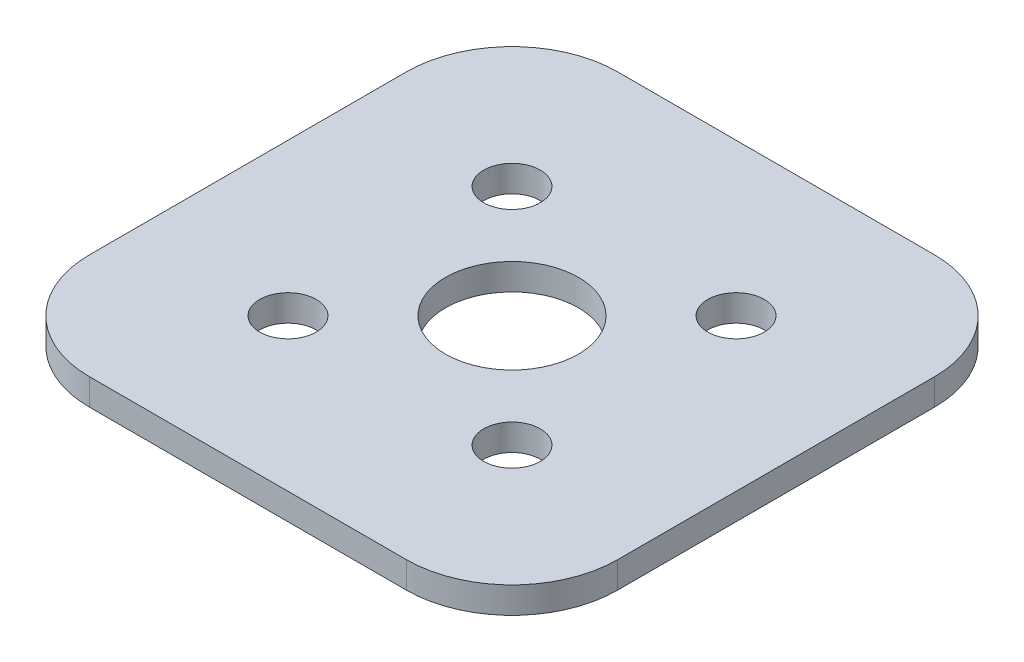
ISO-10303-21;
HEADER;
FILE_DESCRIPTION(('STEP AP214'),'2;1');
FILE_NAME('part.step','',(''),(''),'','','');
FILE_SCHEMA(('AUTOMOTIVE_DESIGN { 1 0 10303 214 1 1 1 1 }'));
ENDSEC;
DATA;
#1=APPLICATION_CONTEXT('core data for automotive mechanical design processes');
#2=APPLICATION_PROTOCOL_DEFINITION('international standard','automotive_design',2000,#1);
#3=PRODUCT_CONTEXT('',#1,'mechanical');
#4=PRODUCT('Part','Part','',(#3));
#5=PRODUCT_RELATED_PRODUCT_CATEGORY('part','',(#4));
#6=PRODUCT_DEFINITION_FORMATION('','',#4);
#7=PRODUCT_DEFINITION_CONTEXT('part definition',#1,'design');
#8=PRODUCT_DEFINITION('design','',#6,#7);
#9=PRODUCT_DEFINITION_SHAPE('','',#8);
#10=(LENGTH_UNIT() NAMED_UNIT(*) SI_UNIT(.MILLI.,.METRE.));
#11=(NAMED_UNIT(*) PLANE_ANGLE_UNIT() SI_UNIT($,.RADIAN.));
#12=(NAMED_UNIT(*) SI_UNIT($,.STERADIAN.) SOLID_ANGLE_UNIT());
#13=UNCERTAINTY_MEASURE_WITH_UNIT(LENGTH_MEASURE(1.E-05),#10,'distance_accuracy_value','');
#14=(GEOMETRIC_REPRESENTATION_CONTEXT(3) GLOBAL_UNCERTAINTY_ASSIGNED_CONTEXT((#13)) GLOBAL_UNIT_ASSIGNED_CONTEXT((#10,
#11,#12)) REPRESENTATION_CONTEXT('',''));
#15=CARTESIAN_POINT('',(0.,0.,0.));
#16=DIRECTION('',(0.,0.,1.));
#17=DIRECTION('',(1.,0.,0.));
#18=AXIS2_PLACEMENT_3D('',#15,#16,#17);
#19=CARTESIAN_POINT('',(-9.52500000000001,1.5875,-9.525));
#20=DIRECTION('',(0.,-1.,0.));
#21=DIRECTION('',(0.,0.,-1.));
#22=AXIS2_PLACEMENT_3D('',#19,#20,#21);
#23=PLANE('',#22);
#24=CARTESIAN_POINT('',(-9.52500000000001,1.5875,-9.525));
#25=DIRECTION('',(0.,1.,0.));
#26=DIRECTION('',(0.,0.,-1.));
#27=AXIS2_PLACEMENT_3D('',#24,#25,#26);
#28=CIRCLE('',#27,6.35);
#29=CARTESIAN_POINT('',(-9.52499999999996,1.5875,-15.875));
#30=VERTEX_POINT('',#29);
#31=CARTESIAN_POINT('',(-15.875,1.5875,-9.52499999999995));
#32=VERTEX_POINT('',#31);
#33=EDGE_CURVE('E168',#30,#32,#28,.T.);
#34=ORIENTED_EDGE('',*,*,#33,.T.);
#35=DIRECTION('',(0.,0.,1.));
#36=VECTOR('',#35,1.);
#37=CARTESIAN_POINT('',(-15.875,1.5875,-9.52499999999995));
#38=LINE('',#37,#36);
#39=CARTESIAN_POINT('',(-15.875,1.5875,9.52499999999996));
#40=VERTEX_POINT('',#39);
#41=EDGE_CURVE('E104',#32,#40,#38,.T.);
#42=ORIENTED_EDGE('',*,*,#41,.T.);
#43=CARTESIAN_POINT('',(-9.525,1.5875,9.525));
#44=DIRECTION('',(0.,1.,0.));
#45=DIRECTION('',(0.,0.,-1.));
#46=AXIS2_PLACEMENT_3D('',#43,#44,#45);
#47=CIRCLE('',#46,6.35);
#48=CARTESIAN_POINT('',(-9.52499999999995,1.5875,15.875));
#49=VERTEX_POINT('',#48);
#50=EDGE_CURVE('E189',#40,#49,#47,.T.);
#51=ORIENTED_EDGE('',*,*,#50,.T.);
#52=DIRECTION('',(1.,0.,0.));
#53=VECTOR('',#52,1.);
#54=CARTESIAN_POINT('',(-9.52499999999995,1.5875,15.875));
#55=LINE('',#54,#53);
#56=CARTESIAN_POINT('',(9.52499999999996,1.5875,15.875));
#57=VERTEX_POINT('',#56);
#58=EDGE_CURVE('E203',#49,#57,#55,.T.);
#59=ORIENTED_EDGE('',*,*,#58,.T.);
#60=CARTESIAN_POINT('',(9.525,1.5875,9.52500000000001));
#61=DIRECTION('',(0.,1.,0.));
#62=DIRECTION('',(0.,0.,1.));
#63=AXIS2_PLACEMENT_3D('',#60,#61,#62);
#64=CIRCLE('',#63,6.35);
#65=CARTESIAN_POINT('',(15.875,1.5875,9.52499999999996));
#66=VERTEX_POINT('',#65);
#67=EDGE_CURVE('E123',#57,#66,#64,.T.);
#68=ORIENTED_EDGE('',*,*,#67,.T.);
#69=DIRECTION('',(0.,0.,-1.));
#70=VECTOR('',#69,1.);
#71=CARTESIAN_POINT('',(15.875,1.5875,-9.52499999999995));
#72=LINE('',#71,#70);
#73=CARTESIAN_POINT('',(15.875,1.5875,-9.52499999999995));
#74=VERTEX_POINT('',#73);
#75=EDGE_CURVE('E117',#66,#74,#72,.T.);
#76=ORIENTED_EDGE('',*,*,#75,.T.);
#77=CARTESIAN_POINT('',(9.52499999999999,1.5875,-9.525));
#78=DIRECTION('',(0.,1.,0.));
#79=DIRECTION('',(0.,0.,-1.));
#80=AXIS2_PLACEMENT_3D('',#77,#78,#79);
#81=CIRCLE('',#80,6.35);
#82=CARTESIAN_POINT('',(9.52499999999995,1.5875,-15.875));
#83=VERTEX_POINT('',#82);
#84=EDGE_CURVE('E121',#74,#83,#81,.T.);
#85=ORIENTED_EDGE('',*,*,#84,.T.);
#86=DIRECTION('',(-1.,0.,0.));
#87=VECTOR('',#86,1.);
#88=CARTESIAN_POINT('',(-9.52499999999996,1.5875,-15.875));
#89=LINE('',#88,#87);
#90=EDGE_CURVE('E61',#83,#30,#89,.T.);
#91=ORIENTED_EDGE('',*,*,#90,.T.);
#92=EDGE_LOOP('',(#34,#42,#51,#59,#68,#76,#85,#91));
#93=FACE_BOUND('',#92,.T.);
#94=CARTESIAN_POINT('',(-6.73519209080184,1.5875,6.73519209080188));
#95=DIRECTION('',(0.,1.,0.));
#96=DIRECTION('',(0.,0.,1.));
#97=AXIS2_PLACEMENT_3D('',#94,#95,#96);
#98=CIRCLE('',#97,1.6999966);
#99=CARTESIAN_POINT('',(-6.73519209080184,1.5875,8.43518869080188));
#100=VERTEX_POINT('',#99);
#101=EDGE_CURVE('E150',#100,#100,#98,.T.);
#102=ORIENTED_EDGE('',*,*,#101,.F.);
#103=EDGE_LOOP('',(#102));
#104=FACE_BOUND('',#103,.T.);
#105=CARTESIAN_POINT('',(6.73519209080183,1.5875,6.7351920908019));
#106=DIRECTION('',(0.,1.,0.));
#107=DIRECTION('',(0.,0.,1.));
#108=AXIS2_PLACEMENT_3D('',#105,#106,#107);
#109=CIRCLE('',#108,1.6999966);
#110=CARTESIAN_POINT('',(6.73519209080183,1.5875,8.4351886908019));
#111=VERTEX_POINT('',#110);
#112=EDGE_CURVE('E217',#111,#111,#109,.T.);
#113=ORIENTED_EDGE('',*,*,#112,.F.);
#114=EDGE_LOOP('',(#113));
#115=FACE_BOUND('',#114,.T.);
#116=CARTESIAN_POINT('',(0.,1.5875,0.));
#117=DIRECTION('',(0.,1.,0.));
#118=DIRECTION('',(0.,0.,1.));
#119=AXIS2_PLACEMENT_3D('',#116,#117,#118);
#120=CIRCLE('',#119,4.00000000000001);
#121=CARTESIAN_POINT('',(0.,1.5875,4.00000000000001));
#122=VERTEX_POINT('',#121);
#123=EDGE_CURVE('E225',#122,#122,#120,.T.);
#124=ORIENTED_EDGE('',*,*,#123,.F.);
#125=EDGE_LOOP('',(#124));
#126=FACE_BOUND('',#125,.T.);
#127=CARTESIAN_POINT('',(6.73519209080183,1.5875,-6.73519209080189));
#128=DIRECTION('',(0.,1.,0.));
#129=DIRECTION('',(0.,0.,1.));
#130=AXIS2_PLACEMENT_3D('',#127,#128,#129);
#131=CIRCLE('',#130,1.6999966);
#132=CARTESIAN_POINT('',(6.73519209080183,1.5875,-5.03519549080189));
#133=VERTEX_POINT('',#132);
#134=EDGE_CURVE('E233',#133,#133,#131,.T.);
#135=ORIENTED_EDGE('',*,*,#134,.F.);
#136=EDGE_LOOP('',(#135));
#137=FACE_BOUND('',#136,.T.);
#138=CARTESIAN_POINT('',(-6.73519209080184,1.5875,-6.73519209080188));
#139=DIRECTION('',(0.,1.,0.));
#140=DIRECTION('',(0.,0.,1.));
#141=AXIS2_PLACEMENT_3D('',#138,#139,#140);
#142=CIRCLE('',#141,1.6999966);
#143=CARTESIAN_POINT('',(-6.73519209080184,1.5875,-5.03519549080188));
#144=VERTEX_POINT('',#143);
#145=EDGE_CURVE('E241',#144,#144,#142,.T.);
#146=ORIENTED_EDGE('',*,*,#145,.F.);
#147=EDGE_LOOP('',(#146));
#148=FACE_BOUND('',#147,.T.);
#149=ADVANCED_FACE('F43',(#93,#104,#115,#126,#137,#148),#23,.F.);
#150=CARTESIAN_POINT('',(-9.52500000000001,0.,-9.525));
#151=DIRECTION('',(0.,-1.,0.));
#152=DIRECTION('',(0.,0.,-1.));
#153=AXIS2_PLACEMENT_3D('',#150,#151,#152);
#154=PLANE('',#153);
#155=CARTESIAN_POINT('',(6.73519209080183,0.,-6.73519209080189));
#156=DIRECTION('',(0.,1.,0.));
#157=DIRECTION('',(0.,0.,1.));
#158=AXIS2_PLACEMENT_3D('',#155,#156,#157);
#159=CIRCLE('',#158,1.6999966);
#160=CARTESIAN_POINT('',(6.73519209080183,0.,-5.03519549080189));
#161=VERTEX_POINT('',#160);
#162=EDGE_CURVE('E237',#161,#161,#159,.T.);
#163=ORIENTED_EDGE('',*,*,#162,.T.);
#164=EDGE_LOOP('',(#163));
#165=FACE_BOUND('',#164,.T.);
#166=CARTESIAN_POINT('',(6.73519209080183,0.,6.7351920908019));
#167=DIRECTION('',(0.,1.,0.));
#168=DIRECTION('',(0.,0.,1.));
#169=AXIS2_PLACEMENT_3D('',#166,#167,#168);
#170=CIRCLE('',#169,1.6999966);
#171=CARTESIAN_POINT('',(6.73519209080183,0.,8.4351886908019));
#172=VERTEX_POINT('',#171);
#173=EDGE_CURVE('E221',#172,#172,#170,.T.);
#174=ORIENTED_EDGE('',*,*,#173,.T.);
#175=EDGE_LOOP('',(#174));
#176=FACE_BOUND('',#175,.T.);
#177=CARTESIAN_POINT('',(-9.52500000000001,0.,-9.525));
#178=DIRECTION('',(0.,1.,0.));
#179=DIRECTION('',(0.,0.,-1.));
#180=AXIS2_PLACEMENT_3D('',#177,#178,#179);
#181=CIRCLE('',#180,6.35);
#182=CARTESIAN_POINT('',(-9.52499999999996,0.,-15.875));
#183=VERTEX_POINT('',#182);
#184=CARTESIAN_POINT('',(-15.875,0.,-9.52499999999995));
#185=VERTEX_POINT('',#184);
#186=EDGE_CURVE('E145',#183,#185,#181,.T.);
#187=ORIENTED_EDGE('',*,*,#186,.F.);
#188=DIRECTION('',(-1.,0.,0.));
#189=VECTOR('',#188,1.);
#190=CARTESIAN_POINT('',(-9.52499999999996,0.,-15.875));
#191=LINE('',#190,#189);
#192=CARTESIAN_POINT('',(9.52499999999995,0.,-15.875));
#193=VERTEX_POINT('',#192);
#194=EDGE_CURVE('E96',#193,#183,#191,.T.);
#195=ORIENTED_EDGE('',*,*,#194,.F.);
#196=CARTESIAN_POINT('',(9.52499999999999,0.,-9.525));
#197=DIRECTION('',(0.,1.,0.));
#198=DIRECTION('',(0.,0.,-1.));
#199=AXIS2_PLACEMENT_3D('',#196,#197,#198);
#200=CIRCLE('',#199,6.35);
#201=CARTESIAN_POINT('',(15.875,0.,-9.52499999999995));
#202=VERTEX_POINT('',#201);
#203=EDGE_CURVE('E90',#202,#193,#200,.T.);
#204=ORIENTED_EDGE('',*,*,#203,.F.);
#205=DIRECTION('',(0.,0.,-1.));
#206=VECTOR('',#205,1.);
#207=CARTESIAN_POINT('',(15.875,0.,-9.52499999999995));
#208=LINE('',#207,#206);
#209=CARTESIAN_POINT('',(15.875,0.,9.52499999999996));
#210=VERTEX_POINT('',#209);
#211=EDGE_CURVE('E132',#210,#202,#208,.T.);
#212=ORIENTED_EDGE('',*,*,#211,.F.);
#213=CARTESIAN_POINT('',(9.525,0.,9.52500000000001));
#214=DIRECTION('',(0.,1.,0.));
#215=DIRECTION('',(0.,0.,1.));
#216=AXIS2_PLACEMENT_3D('',#213,#214,#215);
#217=CIRCLE('',#216,6.35);
#218=CARTESIAN_POINT('',(9.52499999999996,0.,15.875));
#219=VERTEX_POINT('',#218);
#220=EDGE_CURVE('E159',#219,#210,#217,.T.);
#221=ORIENTED_EDGE('',*,*,#220,.F.);
#222=DIRECTION('',(1.,0.,0.));
#223=VECTOR('',#222,1.);
#224=CARTESIAN_POINT('',(-9.52499999999995,0.,15.875));
#225=LINE('',#224,#223);
#226=CARTESIAN_POINT('',(-9.52499999999995,0.,15.875));
#227=VERTEX_POINT('',#226);
#228=EDGE_CURVE('E156',#227,#219,#225,.T.);
#229=ORIENTED_EDGE('',*,*,#228,.F.);
#230=CARTESIAN_POINT('',(-9.525,0.,9.525));
#231=DIRECTION('',(0.,1.,0.));
#232=DIRECTION('',(0.,0.,-1.));
#233=AXIS2_PLACEMENT_3D('',#230,#231,#232);
#234=CIRCLE('',#233,6.35);
#235=CARTESIAN_POINT('',(-15.875,0.,9.52499999999996));
#236=VERTEX_POINT('',#235);
#237=EDGE_CURVE('E153',#236,#227,#234,.T.);
#238=ORIENTED_EDGE('',*,*,#237,.F.);
#239=DIRECTION('',(0.,0.,1.));
#240=VECTOR('',#239,1.);
#241=CARTESIAN_POINT('',(-15.875,0.,-9.52499999999995));
#242=LINE('',#241,#240);
#243=EDGE_CURVE('E149',#185,#236,#242,.T.);
#244=ORIENTED_EDGE('',*,*,#243,.F.);
#245=EDGE_LOOP('',(#187,#195,#204,#212,#221,#229,#238,#244));
#246=FACE_BOUND('',#245,.T.);
#247=CARTESIAN_POINT('',(-6.73519209080184,0.,6.73519209080188));
#248=DIRECTION('',(0.,1.,0.));
#249=DIRECTION('',(0.,0.,1.));
#250=AXIS2_PLACEMENT_3D('',#247,#248,#249);
#251=CIRCLE('',#250,1.6999966);
#252=CARTESIAN_POINT('',(-6.73519209080184,0.,8.43518869080188));
#253=VERTEX_POINT('',#252);
#254=EDGE_CURVE('E213',#253,#253,#251,.T.);
#255=ORIENTED_EDGE('',*,*,#254,.T.);
#256=EDGE_LOOP('',(#255));
#257=FACE_BOUND('',#256,.T.);
#258=CARTESIAN_POINT('',(0.,0.,0.));
#259=DIRECTION('',(0.,1.,0.));
#260=DIRECTION('',(0.,0.,1.));
#261=AXIS2_PLACEMENT_3D('',#258,#259,#260);
#262=CIRCLE('',#261,4.00000000000001);
#263=CARTESIAN_POINT('',(0.,0.,4.00000000000001));
#264=VERTEX_POINT('',#263);
#265=EDGE_CURVE('E229',#264,#264,#262,.T.);
#266=ORIENTED_EDGE('',*,*,#265,.T.);
#267=EDGE_LOOP('',(#266));
#268=FACE_BOUND('',#267,.T.);
#269=CARTESIAN_POINT('',(-6.73519209080184,0.,-6.73519209080188));
#270=DIRECTION('',(0.,1.,0.));
#271=DIRECTION('',(0.,0.,1.));
#272=AXIS2_PLACEMENT_3D('',#269,#270,#271);
#273=CIRCLE('',#272,1.6999966);
#274=CARTESIAN_POINT('',(-6.73519209080184,0.,-5.03519549080188));
#275=VERTEX_POINT('',#274);
#276=EDGE_CURVE('E245',#275,#275,#273,.T.);
#277=ORIENTED_EDGE('',*,*,#276,.T.);
#278=EDGE_LOOP('',(#277));
#279=FACE_BOUND('',#278,.T.);
#280=ADVANCED_FACE('F193',(#165,#176,#246,#257,#268,#279),#154,.T.);
#281=CARTESIAN_POINT('',(-9.52500000000001,1.5875,-9.525));
#282=DIRECTION('',(0.,-1.,0.));
#283=DIRECTION('',(0.,0.,-1.));
#284=AXIS2_PLACEMENT_3D('',#281,#282,#283);
#285=CYLINDRICAL_SURFACE('',#284,6.35);
#286=ORIENTED_EDGE('',*,*,#186,.T.);
#287=DIRECTION('',(0.,-1.,0.));
#288=VECTOR('',#287,1.);
#289=CARTESIAN_POINT('',(-15.875,1.5875,-9.52499999999995));
#290=LINE('',#289,#288);
#291=EDGE_CURVE('E11',#32,#185,#290,.T.);
#292=ORIENTED_EDGE('',*,*,#291,.F.);
#293=ORIENTED_EDGE('',*,*,#33,.F.);
#294=DIRECTION('',(0.,-1.,0.));
#295=VECTOR('',#294,1.);
#296=CARTESIAN_POINT('',(-9.52499999999996,1.5875,-15.875));
#297=LINE('',#296,#295);
#298=EDGE_CURVE('E141',#30,#183,#297,.T.);
#299=ORIENTED_EDGE('',*,*,#298,.T.);
#300=EDGE_LOOP('',(#286,#292,#293,#299));
#301=FACE_BOUND('',#300,.T.);
#302=ADVANCED_FACE('F45',(#301),#285,.T.);
#303=CARTESIAN_POINT('',(-15.875,1.5875,-9.52499999999995));
#304=DIRECTION('',(1.,0.,0.));
#305=DIRECTION('',(0.,0.,-1.));
#306=AXIS2_PLACEMENT_3D('',#303,#304,#305);
#307=PLANE('',#306);
#308=ORIENTED_EDGE('',*,*,#243,.T.);
#309=DIRECTION('',(0.,-1.,0.));
#310=VECTOR('',#309,1.);
#311=CARTESIAN_POINT('',(-15.875,1.5875,9.52499999999996));
#312=LINE('',#311,#310);
#313=EDGE_CURVE('E53',#40,#236,#312,.T.);
#314=ORIENTED_EDGE('',*,*,#313,.F.);
#315=ORIENTED_EDGE('',*,*,#41,.F.);
#316=ORIENTED_EDGE('',*,*,#291,.T.);
#317=EDGE_LOOP('',(#308,#314,#315,#316));
#318=FACE_BOUND('',#317,.T.);
#319=ADVANCED_FACE('F279',(#318),#307,.F.);
#320=CARTESIAN_POINT('',(-9.525,1.5875,9.525));
#321=DIRECTION('',(0.,-1.,0.));
#322=DIRECTION('',(0.,0.,-1.));
#323=AXIS2_PLACEMENT_3D('',#320,#321,#322);
#324=CYLINDRICAL_SURFACE('',#323,6.35);
#325=ORIENTED_EDGE('',*,*,#237,.T.);
#326=DIRECTION('',(0.,-1.,0.));
#327=VECTOR('',#326,1.);
#328=CARTESIAN_POINT('',(-9.52499999999995,1.5875,15.875));
#329=LINE('',#328,#327);
#330=EDGE_CURVE('E179',#49,#227,#329,.T.);
#331=ORIENTED_EDGE('',*,*,#330,.F.);
#332=ORIENTED_EDGE('',*,*,#50,.F.);
#333=ORIENTED_EDGE('',*,*,#313,.T.);
#334=EDGE_LOOP('',(#325,#331,#332,#333));
#335=FACE_BOUND('',#334,.T.);
#336=ADVANCED_FACE('F187',(#335),#324,.T.);
#337=CARTESIAN_POINT('',(-9.52499999999995,1.5875,15.875));
#338=DIRECTION('',(0.,0.,-1.));
#339=DIRECTION('',(-1.,0.,0.));
#340=AXIS2_PLACEMENT_3D('',#337,#338,#339);
#341=PLANE('',#340);
#342=ORIENTED_EDGE('',*,*,#228,.T.);
#343=DIRECTION('',(0.,-1.,0.));
#344=VECTOR('',#343,1.);
#345=CARTESIAN_POINT('',(9.52499999999996,1.5875,15.875));
#346=LINE('',#345,#344);
#347=EDGE_CURVE('E175',#57,#219,#346,.T.);
#348=ORIENTED_EDGE('',*,*,#347,.F.);
#349=ORIENTED_EDGE('',*,*,#58,.F.);
#350=ORIENTED_EDGE('',*,*,#330,.T.);
#351=EDGE_LOOP('',(#342,#348,#349,#350));
#352=FACE_BOUND('',#351,.T.);
#353=ADVANCED_FACE('F198',(#352),#341,.F.);
#354=CARTESIAN_POINT('',(9.525,1.5875,9.52500000000001));
#355=DIRECTION('',(0.,-1.,0.));
#356=DIRECTION('',(0.,0.,-1.));
#357=AXIS2_PLACEMENT_3D('',#354,#355,#356);
#358=CYLINDRICAL_SURFACE('',#357,6.35);
#359=ORIENTED_EDGE('',*,*,#220,.T.);
#360=DIRECTION('',(0.,-1.,0.));
#361=VECTOR('',#360,1.);
#362=CARTESIAN_POINT('',(15.875,1.5875,9.52499999999996));
#363=LINE('',#362,#361);
#364=EDGE_CURVE('E134',#66,#210,#363,.T.);
#365=ORIENTED_EDGE('',*,*,#364,.F.);
#366=ORIENTED_EDGE('',*,*,#67,.F.);
#367=ORIENTED_EDGE('',*,*,#347,.T.);
#368=EDGE_LOOP('',(#359,#365,#366,#367));
#369=FACE_BOUND('',#368,.T.);
#370=ADVANCED_FACE('F201',(#369),#358,.T.);
#371=CARTESIAN_POINT('',(15.875,1.5875,-9.52499999999995));
#372=DIRECTION('',(-1.,0.,0.));
#373=DIRECTION('',(0.,0.,1.));
#374=AXIS2_PLACEMENT_3D('',#371,#372,#373);
#375=PLANE('',#374);
#376=ORIENTED_EDGE('',*,*,#211,.T.);
#377=DIRECTION('',(0.,-1.,0.));
#378=VECTOR('',#377,1.);
#379=CARTESIAN_POINT('',(15.875,1.5875,-9.52499999999995));
#380=LINE('',#379,#378);
#381=EDGE_CURVE('E129',#74,#202,#380,.T.);
#382=ORIENTED_EDGE('',*,*,#381,.F.);
#383=ORIENTED_EDGE('',*,*,#75,.F.);
#384=ORIENTED_EDGE('',*,*,#364,.T.);
#385=EDGE_LOOP('',(#376,#382,#383,#384));
#386=FACE_BOUND('',#385,.T.);
#387=ADVANCED_FACE('F130',(#386),#375,.F.);
#388=CARTESIAN_POINT('',(9.52499999999999,1.5875,-9.525));
#389=DIRECTION('',(0.,-1.,0.));
#390=DIRECTION('',(0.,0.,-1.));
#391=AXIS2_PLACEMENT_3D('',#388,#389,#390);
#392=CYLINDRICAL_SURFACE('',#391,6.35);
#393=ORIENTED_EDGE('',*,*,#203,.T.);
#394=DIRECTION('',(0.,-1.,0.));
#395=VECTOR('',#394,1.);
#396=CARTESIAN_POINT('',(9.52499999999995,1.5875,-15.875));
#397=LINE('',#396,#395);
#398=EDGE_CURVE('E135',#83,#193,#397,.T.);
#399=ORIENTED_EDGE('',*,*,#398,.F.);
#400=ORIENTED_EDGE('',*,*,#84,.F.);
#401=ORIENTED_EDGE('',*,*,#381,.T.);
#402=EDGE_LOOP('',(#393,#399,#400,#401));
#403=FACE_BOUND('',#402,.T.);
#404=ADVANCED_FACE('F137',(#403),#392,.T.);
#405=CARTESIAN_POINT('',(-9.52499999999996,1.5875,-15.875));
#406=DIRECTION('',(0.,0.,1.));
#407=DIRECTION('',(1.,0.,0.));
#408=AXIS2_PLACEMENT_3D('',#405,#406,#407);
#409=PLANE('',#408);
#410=ORIENTED_EDGE('',*,*,#194,.T.);
#411=ORIENTED_EDGE('',*,*,#298,.F.);
#412=ORIENTED_EDGE('',*,*,#90,.F.);
#413=ORIENTED_EDGE('',*,*,#398,.T.);
#414=EDGE_LOOP('',(#410,#411,#412,#413));
#415=FACE_BOUND('',#414,.T.);
#416=ADVANCED_FACE('F267',(#415),#409,.F.);
#417=CARTESIAN_POINT('',(-6.73519209080184,1.5875,6.73519209080188));
#418=DIRECTION('',(0.,-1.,0.));
#419=DIRECTION('',(0.,0.,-1.));
#420=AXIS2_PLACEMENT_3D('',#417,#418,#419);
#421=CYLINDRICAL_SURFACE('',#420,1.6999966);
#422=ORIENTED_EDGE('',*,*,#101,.T.);
#423=EDGE_LOOP('',(#422));
#424=FACE_BOUND('',#423,.T.);
#425=ORIENTED_EDGE('',*,*,#254,.F.);
#426=EDGE_LOOP('',(#425));
#427=FACE_BOUND('',#426,.T.);
#428=ADVANCED_FACE('F264',(#424,#427),#421,.F.);
#429=CARTESIAN_POINT('',(6.73519209080183,1.5875,6.7351920908019));
#430=DIRECTION('',(0.,-1.,0.));
#431=DIRECTION('',(0.,0.,-1.));
#432=AXIS2_PLACEMENT_3D('',#429,#430,#431);
#433=CYLINDRICAL_SURFACE('',#432,1.6999966);
#434=ORIENTED_EDGE('',*,*,#112,.T.);
#435=EDGE_LOOP('',(#434));
#436=FACE_BOUND('',#435,.T.);
#437=ORIENTED_EDGE('',*,*,#173,.F.);
#438=EDGE_LOOP('',(#437));
#439=FACE_BOUND('',#438,.T.);
#440=ADVANCED_FACE('F355',(#436,#439),#433,.F.);
#441=CARTESIAN_POINT('',(0.,1.5875,0.));
#442=DIRECTION('',(0.,-1.,0.));
#443=DIRECTION('',(0.,0.,-1.));
#444=AXIS2_PLACEMENT_3D('',#441,#442,#443);
#445=CYLINDRICAL_SURFACE('',#444,4.00000000000001);
#446=ORIENTED_EDGE('',*,*,#123,.T.);
#447=EDGE_LOOP('',(#446));
#448=FACE_BOUND('',#447,.T.);
#449=ORIENTED_EDGE('',*,*,#265,.F.);
#450=EDGE_LOOP('',(#449));
#451=FACE_BOUND('',#450,.T.);
#452=ADVANCED_FACE('F364',(#448,#451),#445,.F.);
#453=CARTESIAN_POINT('',(6.73519209080183,1.5875,-6.73519209080189));
#454=DIRECTION('',(0.,-1.,0.));
#455=DIRECTION('',(0.,0.,-1.));
#456=AXIS2_PLACEMENT_3D('',#453,#454,#455);
#457=CYLINDRICAL_SURFACE('',#456,1.6999966);
#458=ORIENTED_EDGE('',*,*,#134,.T.);
#459=EDGE_LOOP('',(#458));
#460=FACE_BOUND('',#459,.T.);
#461=ORIENTED_EDGE('',*,*,#162,.F.);
#462=EDGE_LOOP('',(#461));
#463=FACE_BOUND('',#462,.T.);
#464=ADVANCED_FACE('F373',(#460,#463),#457,.F.);
#465=CARTESIAN_POINT('',(-6.73519209080184,1.5875,-6.73519209080188));
#466=DIRECTION('',(0.,-1.,0.));
#467=DIRECTION('',(0.,0.,-1.));
#468=AXIS2_PLACEMENT_3D('',#465,#466,#467);
#469=CYLINDRICAL_SURFACE('',#468,1.6999966);
#470=ORIENTED_EDGE('',*,*,#145,.T.);
#471=EDGE_LOOP('',(#470));
#472=FACE_BOUND('',#471,.T.);
#473=ORIENTED_EDGE('',*,*,#276,.F.);
#474=EDGE_LOOP('',(#473));
#475=FACE_BOUND('',#474,.T.);
#476=ADVANCED_FACE('F253',(#472,#475),#469,.F.);
#477=CLOSED_SHELL('',(#149,#280,#302,#319,#336,#353,#370,#387,#404,#416,#428,#440,#452,#464,#476));
#478=MANIFOLD_SOLID_BREP('B2',#477);
#479=ADVANCED_BREP_SHAPE_REPRESENTATION('',(#18,#478),#14);
#480=SHAPE_DEFINITION_REPRESENTATION(#9,#479);
ENDSEC;
END-ISO-10303-21;
